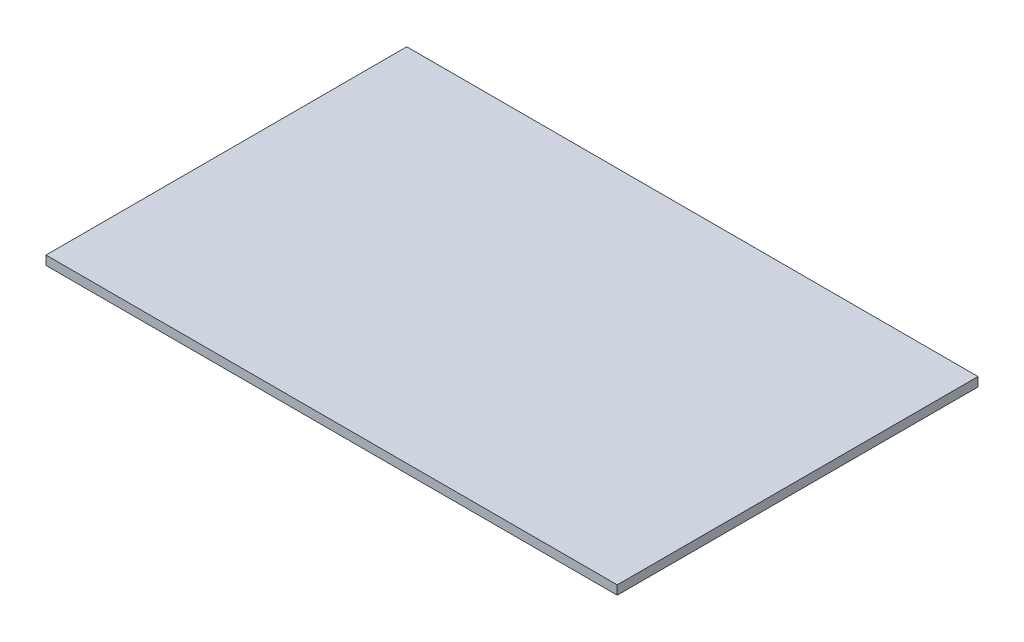
ISO-10303-21;
HEADER;
FILE_DESCRIPTION(('STEP AP214'),'2;1');
FILE_NAME('part.step','',(''),(''),'','','');
FILE_SCHEMA(('AUTOMOTIVE_DESIGN { 1 0 10303 214 1 1 1 1 }'));
ENDSEC;
DATA;
#1=APPLICATION_CONTEXT('core data for automotive mechanical design processes');
#2=APPLICATION_PROTOCOL_DEFINITION('international standard','automotive_design',2000,#1);
#3=PRODUCT_CONTEXT('',#1,'mechanical');
#4=PRODUCT('Part','Part','',(#3));
#5=PRODUCT_RELATED_PRODUCT_CATEGORY('part','',(#4));
#6=PRODUCT_DEFINITION_FORMATION('','',#4);
#7=PRODUCT_DEFINITION_CONTEXT('part definition',#1,'design');
#8=PRODUCT_DEFINITION('design','',#6,#7);
#9=PRODUCT_DEFINITION_SHAPE('','',#8);
#10=(LENGTH_UNIT() NAMED_UNIT(*) SI_UNIT(.MILLI.,.METRE.));
#11=(NAMED_UNIT(*) PLANE_ANGLE_UNIT() SI_UNIT($,.RADIAN.));
#12=(NAMED_UNIT(*) SI_UNIT($,.STERADIAN.) SOLID_ANGLE_UNIT());
#13=UNCERTAINTY_MEASURE_WITH_UNIT(LENGTH_MEASURE(1.E-05),#10,'distance_accuracy_value','');
#14=(GEOMETRIC_REPRESENTATION_CONTEXT(3) GLOBAL_UNCERTAINTY_ASSIGNED_CONTEXT((#13)) GLOBAL_UNIT_ASSIGNED_CONTEXT((#10,
#11,#12)) REPRESENTATION_CONTEXT('',''));
#15=CARTESIAN_POINT('',(0.,0.,0.));
#16=DIRECTION('',(0.,0.,1.));
#17=DIRECTION('',(1.,0.,0.));
#18=AXIS2_PLACEMENT_3D('',#15,#16,#17);
#19=CARTESIAN_POINT('',(0.,3.,0.));
#20=DIRECTION('',(1.,0.,0.));
#21=DIRECTION('',(0.,0.,-1.));
#22=AXIS2_PLACEMENT_3D('',#19,#20,#21);
#23=PLANE('',#22);
#24=DIRECTION('',(0.,0.,1.));
#25=VECTOR('',#24,1.);
#26=CARTESIAN_POINT('',(0.,0.,0.));
#27=LINE('',#26,#25);
#28=CARTESIAN_POINT('',(0.,0.,-120.));
#29=VERTEX_POINT('',#28);
#30=CARTESIAN_POINT('',(0.,0.,0.));
#31=VERTEX_POINT('',#30);
#32=EDGE_CURVE('E96',#29,#31,#27,.T.);
#33=ORIENTED_EDGE('',*,*,#32,.T.);
#34=DIRECTION('',(0.,-1.,0.));
#35=VECTOR('',#34,1.);
#36=CARTESIAN_POINT('',(0.,3.,0.));
#37=LINE('',#36,#35);
#38=CARTESIAN_POINT('',(0.,3.,0.));
#39=VERTEX_POINT('',#38);
#40=EDGE_CURVE('E11',#39,#31,#37,.T.);
#41=ORIENTED_EDGE('',*,*,#40,.F.);
#42=DIRECTION('',(0.,0.,1.));
#43=VECTOR('',#42,1.);
#44=CARTESIAN_POINT('',(0.,3.,0.));
#45=LINE('',#44,#43);
#46=CARTESIAN_POINT('',(0.,3.,-120.));
#47=VERTEX_POINT('',#46);
#48=EDGE_CURVE('E84',#47,#39,#45,.T.);
#49=ORIENTED_EDGE('',*,*,#48,.F.);
#50=DIRECTION('',(0.,-1.,0.));
#51=VECTOR('',#50,1.);
#52=CARTESIAN_POINT('',(0.,3.,-120.));
#53=LINE('',#52,#51);
#54=EDGE_CURVE('E92',#47,#29,#53,.T.);
#55=ORIENTED_EDGE('',*,*,#54,.T.);
#56=EDGE_LOOP('',(#33,#41,#49,#55));
#57=FACE_BOUND('',#56,.T.);
#58=ADVANCED_FACE('F33',(#57),#23,.F.);
#59=CARTESIAN_POINT('',(0.,3.,0.));
#60=DIRECTION('',(0.,0.,-1.));
#61=DIRECTION('',(-1.,0.,0.));
#62=AXIS2_PLACEMENT_3D('',#59,#60,#61);
#63=PLANE('',#62);
#64=DIRECTION('',(1.,0.,0.));
#65=VECTOR('',#64,1.);
#66=CARTESIAN_POINT('',(0.,0.,0.));
#67=LINE('',#66,#65);
#68=CARTESIAN_POINT('',(190.,0.,0.));
#69=VERTEX_POINT('',#68);
#70=EDGE_CURVE('E88',#31,#69,#67,.T.);
#71=ORIENTED_EDGE('',*,*,#70,.T.);
#72=DIRECTION('',(0.,-1.,0.));
#73=VECTOR('',#72,1.);
#74=CARTESIAN_POINT('',(190.,3.,0.));
#75=LINE('',#74,#73);
#76=CARTESIAN_POINT('',(190.,3.,0.));
#77=VERTEX_POINT('',#76);
#78=EDGE_CURVE('E41',#77,#69,#75,.T.);
#79=ORIENTED_EDGE('',*,*,#78,.F.);
#80=DIRECTION('',(1.,0.,0.));
#81=VECTOR('',#80,1.);
#82=CARTESIAN_POINT('',(0.,3.,0.));
#83=LINE('',#82,#81);
#84=EDGE_CURVE('E79',#39,#77,#83,.T.);
#85=ORIENTED_EDGE('',*,*,#84,.F.);
#86=ORIENTED_EDGE('',*,*,#40,.T.);
#87=EDGE_LOOP('',(#71,#79,#85,#86));
#88=FACE_BOUND('',#87,.T.);
#89=ADVANCED_FACE('F87',(#88),#63,.F.);
#90=CARTESIAN_POINT('',(190.,3.,0.));
#91=DIRECTION('',(-1.,0.,0.));
#92=DIRECTION('',(0.,0.,1.));
#93=AXIS2_PLACEMENT_3D('',#90,#91,#92);
#94=PLANE('',#93);
#95=DIRECTION('',(0.,0.,-1.));
#96=VECTOR('',#95,1.);
#97=CARTESIAN_POINT('',(190.,0.,0.));
#98=LINE('',#97,#96);
#99=CARTESIAN_POINT('',(190.,0.,-120.));
#100=VERTEX_POINT('',#99);
#101=EDGE_CURVE('E66',#69,#100,#98,.T.);
#102=ORIENTED_EDGE('',*,*,#101,.T.);
#103=DIRECTION('',(0.,-1.,0.));
#104=VECTOR('',#103,1.);
#105=CARTESIAN_POINT('',(190.,3.,-120.));
#106=LINE('',#105,#104);
#107=CARTESIAN_POINT('',(190.,3.,-120.));
#108=VERTEX_POINT('',#107);
#109=EDGE_CURVE('E89',#108,#100,#106,.T.);
#110=ORIENTED_EDGE('',*,*,#109,.F.);
#111=DIRECTION('',(0.,0.,-1.));
#112=VECTOR('',#111,1.);
#113=CARTESIAN_POINT('',(190.,3.,0.));
#114=LINE('',#113,#112);
#115=EDGE_CURVE('E82',#77,#108,#114,.T.);
#116=ORIENTED_EDGE('',*,*,#115,.F.);
#117=ORIENTED_EDGE('',*,*,#78,.T.);
#118=EDGE_LOOP('',(#102,#110,#116,#117));
#119=FACE_BOUND('',#118,.T.);
#120=ADVANCED_FACE('F90',(#119),#94,.F.);
#121=CARTESIAN_POINT('',(0.,3.,-120.));
#122=DIRECTION('',(0.,0.,1.));
#123=DIRECTION('',(1.,0.,0.));
#124=AXIS2_PLACEMENT_3D('',#121,#122,#123);
#125=PLANE('',#124);
#126=DIRECTION('',(-1.,0.,0.));
#127=VECTOR('',#126,1.);
#128=CARTESIAN_POINT('',(0.,0.,-120.));
#129=LINE('',#128,#127);
#130=EDGE_CURVE('E72',#100,#29,#129,.T.);
#131=ORIENTED_EDGE('',*,*,#130,.T.);
#132=ORIENTED_EDGE('',*,*,#54,.F.);
#133=DIRECTION('',(-1.,0.,0.));
#134=VECTOR('',#133,1.);
#135=CARTESIAN_POINT('',(0.,3.,-120.));
#136=LINE('',#135,#134);
#137=EDGE_CURVE('E49',#108,#47,#136,.T.);
#138=ORIENTED_EDGE('',*,*,#137,.F.);
#139=ORIENTED_EDGE('',*,*,#109,.T.);
#140=EDGE_LOOP('',(#131,#132,#138,#139));
#141=FACE_BOUND('',#140,.T.);
#142=ADVANCED_FACE('F103',(#141),#125,.F.);
#143=CARTESIAN_POINT('',(0.,3.,0.));
#144=DIRECTION('',(0.,-1.,0.));
#145=DIRECTION('',(0.,0.,-1.));
#146=AXIS2_PLACEMENT_3D('',#143,#144,#145);
#147=PLANE('',#146);
#148=ORIENTED_EDGE('',*,*,#48,.T.);
#149=ORIENTED_EDGE('',*,*,#84,.T.);
#150=ORIENTED_EDGE('',*,*,#115,.T.);
#151=ORIENTED_EDGE('',*,*,#137,.T.);
#152=EDGE_LOOP('',(#148,#149,#150,#151));
#153=FACE_BOUND('',#152,.T.);
#154=ADVANCED_FACE('F80',(#153),#147,.F.);
#155=CARTESIAN_POINT('',(0.,0.,0.));
#156=DIRECTION('',(0.,-1.,0.));
#157=DIRECTION('',(0.,0.,-1.));
#158=AXIS2_PLACEMENT_3D('',#155,#156,#157);
#159=PLANE('',#158);
#160=ORIENTED_EDGE('',*,*,#32,.F.);
#161=ORIENTED_EDGE('',*,*,#130,.F.);
#162=ORIENTED_EDGE('',*,*,#101,.F.);
#163=ORIENTED_EDGE('',*,*,#70,.F.);
#164=EDGE_LOOP('',(#160,#161,#162,#163));
#165=FACE_BOUND('',#164,.T.);
#166=ADVANCED_FACE('F106',(#165),#159,.T.);
#167=CLOSED_SHELL('',(#58,#89,#120,#142,#154,#166));
#168=MANIFOLD_SOLID_BREP('B2',#167);
#169=ADVANCED_BREP_SHAPE_REPRESENTATION('',(#18,#168),#14);
#170=SHAPE_DEFINITION_REPRESENTATION(#9,#169);
ENDSEC;
END-ISO-10303-21;
